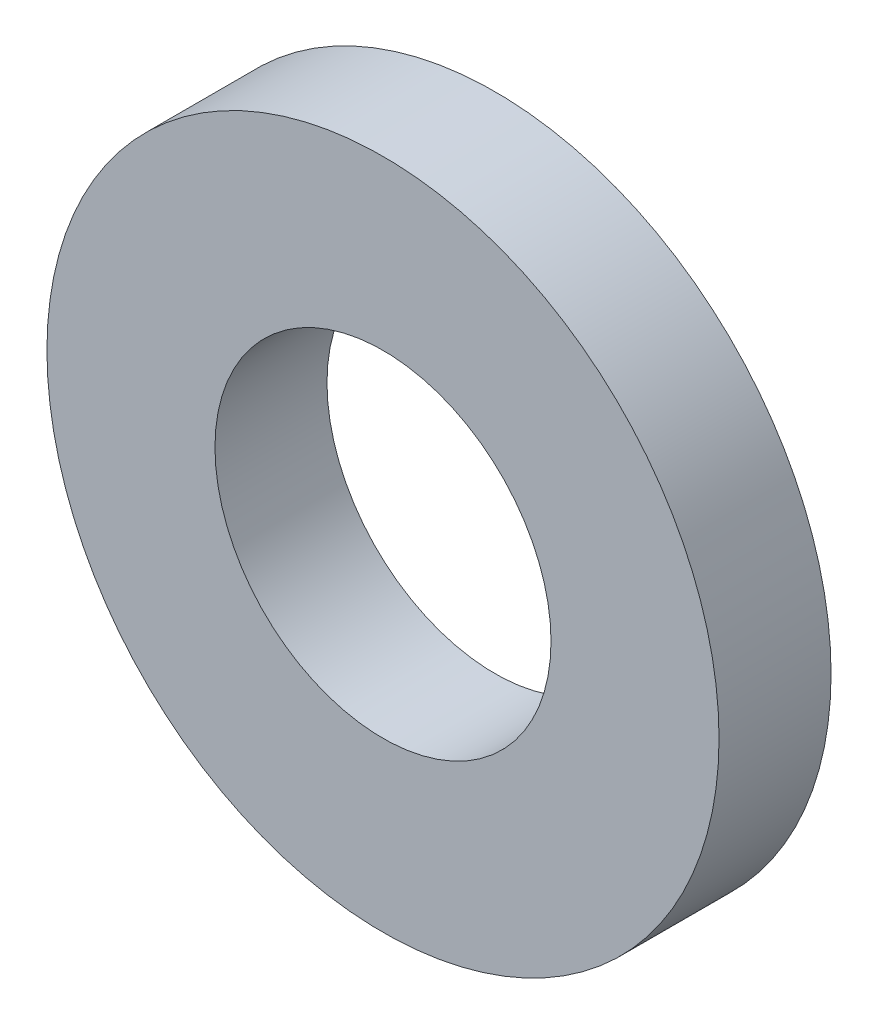
ISO-10303-21;
HEADER;
FILE_DESCRIPTION(('STEP AP214'),'2;1');
FILE_NAME('part.step','',(''),(''),'','','');
FILE_SCHEMA(('AUTOMOTIVE_DESIGN { 1 0 10303 214 1 1 1 1 }'));
ENDSEC;
DATA;
#1=APPLICATION_CONTEXT('core data for automotive mechanical design processes');
#2=APPLICATION_PROTOCOL_DEFINITION('international standard','automotive_design',2000,#1);
#3=PRODUCT_CONTEXT('',#1,'mechanical');
#4=PRODUCT('Part','Part','',(#3));
#5=PRODUCT_RELATED_PRODUCT_CATEGORY('part','',(#4));
#6=PRODUCT_DEFINITION_FORMATION('','',#4);
#7=PRODUCT_DEFINITION_CONTEXT('part definition',#1,'design');
#8=PRODUCT_DEFINITION('design','',#6,#7);
#9=PRODUCT_DEFINITION_SHAPE('','',#8);
#10=(LENGTH_UNIT() NAMED_UNIT(*) SI_UNIT(.MILLI.,.METRE.));
#11=(NAMED_UNIT(*) PLANE_ANGLE_UNIT() SI_UNIT($,.RADIAN.));
#12=(NAMED_UNIT(*) SI_UNIT($,.STERADIAN.) SOLID_ANGLE_UNIT());
#13=UNCERTAINTY_MEASURE_WITH_UNIT(LENGTH_MEASURE(1.E-05),#10,'distance_accuracy_value','');
#14=(GEOMETRIC_REPRESENTATION_CONTEXT(3) GLOBAL_UNCERTAINTY_ASSIGNED_CONTEXT((#13)) GLOBAL_UNIT_ASSIGNED_CONTEXT((#10,
#11,#12)) REPRESENTATION_CONTEXT('',''));
#15=CARTESIAN_POINT('',(0.,0.,0.));
#16=DIRECTION('',(0.,0.,1.));
#17=DIRECTION('',(1.,0.,0.));
#18=AXIS2_PLACEMENT_3D('',#15,#16,#17);
#19=CARTESIAN_POINT('',(0.,0.,2.));
#20=DIRECTION('',(0.,0.,1.));
#21=DIRECTION('',(1.,0.,0.));
#22=AXIS2_PLACEMENT_3D('',#19,#20,#21);
#23=PLANE('',#22);
#24=CARTESIAN_POINT('',(0.,0.,2.));
#25=DIRECTION('',(0.,0.,1.));
#26=DIRECTION('',(1.,0.,0.));
#27=AXIS2_PLACEMENT_3D('',#24,#25,#26);
#28=CIRCLE('',#27,6.);
#29=CARTESIAN_POINT('',(6.,0.,2.));
#30=VERTEX_POINT('',#29);
#31=EDGE_CURVE('E10',#30,#30,#28,.T.);
#32=ORIENTED_EDGE('',*,*,#31,.T.);
#33=EDGE_LOOP('',(#32));
#34=FACE_BOUND('',#33,.T.);
#35=CARTESIAN_POINT('',(0.,0.,2.));
#36=DIRECTION('',(0.,0.,1.));
#37=DIRECTION('',(1.,0.,0.));
#38=AXIS2_PLACEMENT_3D('',#35,#36,#37);
#39=CIRCLE('',#38,3.);
#40=CARTESIAN_POINT('',(3.,0.,2.));
#41=VERTEX_POINT('',#40);
#42=EDGE_CURVE('E54',#41,#41,#39,.T.);
#43=ORIENTED_EDGE('',*,*,#42,.F.);
#44=EDGE_LOOP('',(#43));
#45=FACE_BOUND('',#44,.T.);
#46=ADVANCED_FACE('F41',(#34,#45),#23,.T.);
#47=CARTESIAN_POINT('',(0.,0.,0.));
#48=DIRECTION('',(0.,0.,1.));
#49=DIRECTION('',(1.,0.,0.));
#50=AXIS2_PLACEMENT_3D('',#47,#48,#49);
#51=PLANE('',#50);
#52=CARTESIAN_POINT('',(0.,0.,0.));
#53=DIRECTION('',(0.,0.,1.));
#54=DIRECTION('',(1.,0.,0.));
#55=AXIS2_PLACEMENT_3D('',#52,#53,#54);
#56=CIRCLE('',#55,6.);
#57=CARTESIAN_POINT('',(6.,0.,0.));
#58=VERTEX_POINT('',#57);
#59=EDGE_CURVE('E45',#58,#58,#56,.T.);
#60=ORIENTED_EDGE('',*,*,#59,.F.);
#61=EDGE_LOOP('',(#60));
#62=FACE_BOUND('',#61,.T.);
#63=CARTESIAN_POINT('',(0.,0.,0.));
#64=DIRECTION('',(0.,0.,1.));
#65=DIRECTION('',(1.,0.,0.));
#66=AXIS2_PLACEMENT_3D('',#63,#64,#65);
#67=CIRCLE('',#66,3.);
#68=CARTESIAN_POINT('',(3.,0.,0.));
#69=VERTEX_POINT('',#68);
#70=EDGE_CURVE('E56',#69,#69,#67,.T.);
#71=ORIENTED_EDGE('',*,*,#70,.T.);
#72=EDGE_LOOP('',(#71));
#73=FACE_BOUND('',#72,.T.);
#74=ADVANCED_FACE('F68',(#62,#73),#51,.F.);
#75=CARTESIAN_POINT('',(0.,0.,2.));
#76=DIRECTION('',(0.,0.,-1.));
#77=DIRECTION('',(-1.,0.,0.));
#78=AXIS2_PLACEMENT_3D('',#75,#76,#77);
#79=CYLINDRICAL_SURFACE('',#78,6.);
#80=ORIENTED_EDGE('',*,*,#31,.F.);
#81=EDGE_LOOP('',(#80));
#82=FACE_BOUND('',#81,.T.);
#83=ORIENTED_EDGE('',*,*,#59,.T.);
#84=EDGE_LOOP('',(#83));
#85=FACE_BOUND('',#84,.T.);
#86=ADVANCED_FACE('F43',(#82,#85),#79,.T.);
#87=CARTESIAN_POINT('',(0.,0.,2.));
#88=DIRECTION('',(0.,0.,-1.));
#89=DIRECTION('',(-1.,0.,0.));
#90=AXIS2_PLACEMENT_3D('',#87,#88,#89);
#91=CYLINDRICAL_SURFACE('',#90,3.);
#92=ORIENTED_EDGE('',*,*,#42,.T.);
#93=EDGE_LOOP('',(#92));
#94=FACE_BOUND('',#93,.T.);
#95=ORIENTED_EDGE('',*,*,#70,.F.);
#96=EDGE_LOOP('',(#95));
#97=FACE_BOUND('',#96,.T.);
#98=ADVANCED_FACE('F64',(#94,#97),#91,.F.);
#99=CLOSED_SHELL('',(#46,#74,#86,#98));
#100=MANIFOLD_SOLID_BREP('B2',#99);
#101=ADVANCED_BREP_SHAPE_REPRESENTATION('',(#18,#100),#14);
#102=SHAPE_DEFINITION_REPRESENTATION(#9,#101);
ENDSEC;
END-ISO-10303-21;
